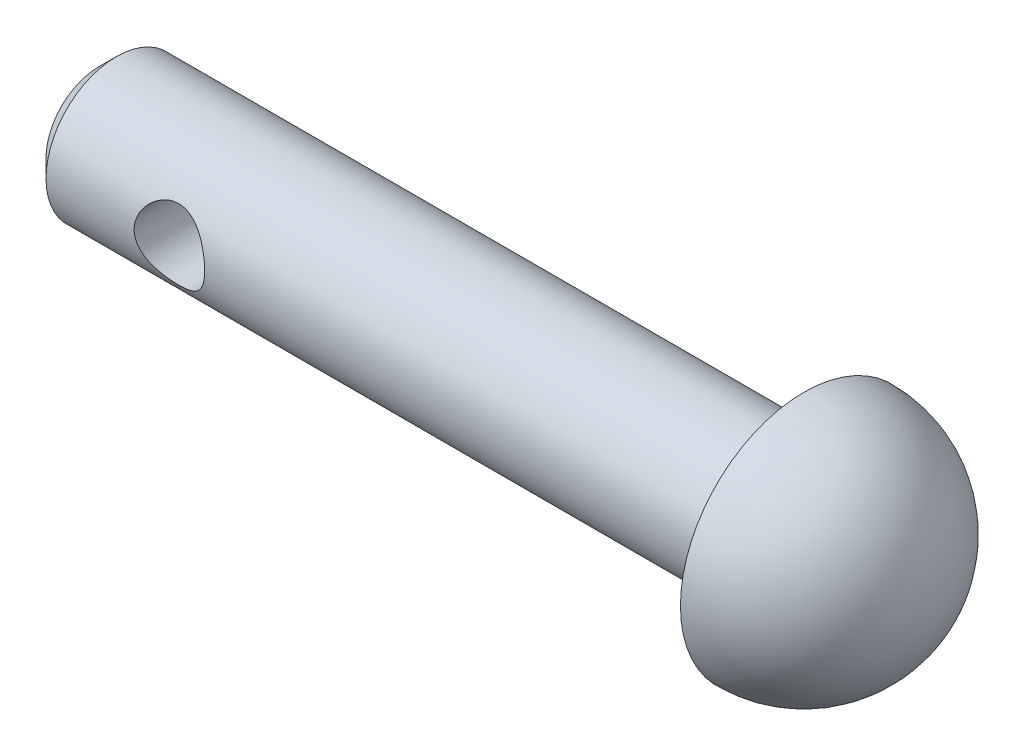
ISO-10303-21;
HEADER;
FILE_DESCRIPTION(('STEP AP214'),'2;1');
FILE_NAME('part.step','',(''),(''),'','','');
FILE_SCHEMA(('AUTOMOTIVE_DESIGN { 1 0 10303 214 1 1 1 1 }'));
ENDSEC;
DATA;
#1=APPLICATION_CONTEXT('core data for automotive mechanical design processes');
#2=APPLICATION_PROTOCOL_DEFINITION('international standard','automotive_design',2000,#1);
#3=PRODUCT_CONTEXT('',#1,'mechanical');
#4=PRODUCT('Part','Part','',(#3));
#5=PRODUCT_RELATED_PRODUCT_CATEGORY('part','',(#4));
#6=PRODUCT_DEFINITION_FORMATION('','',#4);
#7=PRODUCT_DEFINITION_CONTEXT('part definition',#1,'design');
#8=PRODUCT_DEFINITION('design','',#6,#7);
#9=PRODUCT_DEFINITION_SHAPE('','',#8);
#10=(LENGTH_UNIT() NAMED_UNIT(*) SI_UNIT(.MILLI.,.METRE.));
#11=(NAMED_UNIT(*) PLANE_ANGLE_UNIT() SI_UNIT($,.RADIAN.));
#12=(NAMED_UNIT(*) SI_UNIT($,.STERADIAN.) SOLID_ANGLE_UNIT());
#13=UNCERTAINTY_MEASURE_WITH_UNIT(LENGTH_MEASURE(1.E-05),#10,'distance_accuracy_value','');
#14=(GEOMETRIC_REPRESENTATION_CONTEXT(3) GLOBAL_UNCERTAINTY_ASSIGNED_CONTEXT((#13)) GLOBAL_UNIT_ASSIGNED_CONTEXT((#10,
#11,#12)) REPRESENTATION_CONTEXT('',''));
#15=CARTESIAN_POINT('',(0.,0.,0.));
#16=DIRECTION('',(0.,0.,1.));
#17=DIRECTION('',(1.,0.,0.));
#18=AXIS2_PLACEMENT_3D('',#15,#16,#17);
#19=CARTESIAN_POINT('',(0.,0.,0.));
#20=DIRECTION('',(-1.,0.,0.));
#21=DIRECTION('',(0.,1.,0.));
#22=AXIS2_PLACEMENT_3D('',#19,#20,#21);
#23=SPHERICAL_SURFACE('',#22,3.5);
#24=CARTESIAN_POINT('',(0.,0.,0.));
#25=DIRECTION('',(-1.,0.,0.));
#26=DIRECTION('',(0.,0.,1.));
#27=AXIS2_PLACEMENT_3D('',#24,#25,#26);
#28=CIRCLE('',#27,3.5);
#29=CARTESIAN_POINT('',(0.,0.,3.5));
#30=VERTEX_POINT('',#29);
#31=EDGE_CURVE('E45',#30,#30,#28,.T.);
#32=ORIENTED_EDGE('',*,*,#31,.F.);
#33=EDGE_LOOP('',(#32));
#34=FACE_BOUND('',#33,.T.);
#35=ADVANCED_FACE('F33',(#34),#23,.T.);
#36=CARTESIAN_POINT('',(0.,2.,0.));
#37=DIRECTION('',(1.,0.,0.));
#38=DIRECTION('',(0.,0.,-1.));
#39=AXIS2_PLACEMENT_3D('',#36,#37,#38);
#40=PLANE('',#39);
#41=CARTESIAN_POINT('',(0.,0.,0.));
#42=DIRECTION('',(-1.,0.,0.));
#43=DIRECTION('',(0.,0.,1.));
#44=AXIS2_PLACEMENT_3D('',#41,#42,#43);
#45=CIRCLE('',#44,2.);
#46=CARTESIAN_POINT('',(0.,0.,2.));
#47=VERTEX_POINT('',#46);
#48=EDGE_CURVE('E49',#47,#47,#45,.T.);
#49=ORIENTED_EDGE('',*,*,#48,.F.);
#50=EDGE_LOOP('',(#49));
#51=FACE_BOUND('',#50,.T.);
#52=ORIENTED_EDGE('',*,*,#31,.T.);
#53=EDGE_LOOP('',(#52));
#54=FACE_BOUND('',#53,.T.);
#55=ADVANCED_FACE('F78',(#51,#54),#40,.F.);
#56=CARTESIAN_POINT('',(-20.,0.,0.));
#57=DIRECTION('',(-1.,0.,0.));
#58=DIRECTION('',(0.,0.,1.));
#59=AXIS2_PLACEMENT_3D('',#56,#57,#58);
#60=CYLINDRICAL_SURFACE('',#59,2.);
#61=CARTESIAN_POINT('',(-19.5,0.,0.));
#62=DIRECTION('',(1.,0.,0.));
#63=DIRECTION('',(0.,0.,-1.));
#64=AXIS2_PLACEMENT_3D('',#61,#62,#63);
#65=CIRCLE('',#64,2.);
#66=CARTESIAN_POINT('',(-19.5,0.,-2.));
#67=VERTEX_POINT('',#66);
#68=EDGE_CURVE('E10',#67,#67,#65,.T.);
#69=ORIENTED_EDGE('',*,*,#68,.T.);
#70=EDGE_LOOP('',(#69));
#71=FACE_BOUND('',#70,.T.);
#72=CARTESIAN_POINT('',(-15.,0.,2.));
#73=CARTESIAN_POINT('',(-15.0000033023195,-0.0525719629529865,1.99999713404151));
#74=CARTESIAN_POINT('',(-15.0041700731217,-0.105206599698033,1.99790491019518));
#75=CARTESIAN_POINT('',(-15.0206528803409,-0.208920235268425,1.98974156037396));
#76=CARTESIAN_POINT('',(-15.0329843929976,-0.259996086713503,1.98366287828984));
#77=CARTESIAN_POINT('',(-15.0651938086168,-0.358933544880574,1.96816279403312));
#78=CARTESIAN_POINT('',(-15.085042384248,-0.40680680293918,1.9587543917752));
#79=CARTESIAN_POINT('',(-15.1315706213649,-0.498472616806565,1.93745776515779));
#80=CARTESIAN_POINT('',(-15.1582497442489,-0.54226549399005,1.9255697363353));
#81=CARTESIAN_POINT('',(-15.2195172494853,-0.627507817761919,1.89956258258057));
#82=CARTESIAN_POINT('',(-15.2544864792396,-0.668655211122112,1.88535199127536));
#83=CARTESIAN_POINT('',(-15.330521479247,-0.744779444866978,1.85659970246744));
#84=CARTESIAN_POINT('',(-15.3715918517724,-0.779751583106766,1.84205776209035));
#85=CARTESIAN_POINT('',(-15.4624833495234,-0.845252000450278,1.81298951197347));
#86=CARTESIAN_POINT('',(-15.5127360983459,-0.875225335551637,1.79855186970132));
#87=CARTESIAN_POINT('',(-15.6183673359862,-0.926168226890695,1.77285978772321));
#88=CARTESIAN_POINT('',(-15.6737421287227,-0.947144214966334,1.7616030760699));
#89=CARTESIAN_POINT('',(-15.7846651054219,-0.978132442188588,1.74457867037809));
#90=CARTESIAN_POINT('',(-15.8400044520674,-0.988725857080441,1.73852271583714));
#91=CARTESIAN_POINT('',(-15.9519788377795,-1.00042699330885,1.73181889948528));
#92=CARTESIAN_POINT('',(-16.0086125408712,-1.00154408837307,1.73116569343288));
#93=CARTESIAN_POINT('',(-16.1142860243154,-0.994687287172294,1.73510930257248));
#94=CARTESIAN_POINT('',(-16.163424031223,-0.987784559536821,1.73908763662013));
#95=CARTESIAN_POINT('',(-16.259721909373,-0.966939849056933,1.7507622873385));
#96=CARTESIAN_POINT('',(-16.3068811453053,-0.952995623897652,1.75845978831776));
#97=CARTESIAN_POINT('',(-16.3992291325657,-0.918209780386004,1.77687476412741));
#98=CARTESIAN_POINT('',(-16.4443463987858,-0.897215067115995,1.78765840663998));
#99=CARTESIAN_POINT('',(-16.53063429259,-0.849041687668002,1.81103404281404));
#100=CARTESIAN_POINT('',(-16.5718031356001,-0.821860243812467,1.82362684780191));
#101=CARTESIAN_POINT('',(-16.6545212527432,-0.758066054912787,1.85113157903286));
#102=CARTESIAN_POINT('',(-16.6954568735762,-0.720694458369281,1.86613510236746));
#103=CARTESIAN_POINT('',(-16.7707354185909,-0.639555578741373,1.89547623300407));
#104=CARTESIAN_POINT('',(-16.8050751920339,-0.595785256574286,1.90981351958801));
#105=CARTESIAN_POINT('',(-16.8676856610297,-0.50051650583185,1.93701987282964));
#106=CARTESIAN_POINT('',(-16.8956004724457,-0.44875359159941,1.94978984162007));
#107=CARTESIAN_POINT('',(-16.942097029043,-0.340466215488798,1.97157881121242));
#108=CARTESIAN_POINT('',(-16.9606861850152,-0.283945576265277,1.98060078943553));
#109=CARTESIAN_POINT('',(-16.9864754037167,-0.172766491660702,1.99324333741436));
#110=CARTESIAN_POINT('',(-16.9944912357468,-0.118341530548325,1.99724938301312));
#111=CARTESIAN_POINT('',(-17.0014647311345,-0.00877959994935545,2.00073013459102));
#112=CARTESIAN_POINT('',(-17.0004266856395,0.0463570198698992,2.00020698721312));
#113=CARTESIAN_POINT('',(-16.9897933115812,0.151232971985992,1.99491192253441));
#114=CARTESIAN_POINT('',(-16.98086746727,0.201059408049953,1.9904724568819));
#115=CARTESIAN_POINT('',(-16.9557619281049,0.298406892301916,1.97822171314819));
#116=CARTESIAN_POINT('',(-16.9395814335466,0.345927685690995,1.97041006334332));
#117=CARTESIAN_POINT('',(-16.9000015335668,0.438888608449664,1.95184251413669));
#118=CARTESIAN_POINT('',(-16.8764089498832,0.484230397006152,1.94100881769939));
#119=CARTESIAN_POINT('',(-16.822892464354,0.57046136169892,1.91743974317109));
#120=CARTESIAN_POINT('',(-16.7929658654066,0.611348629775281,1.90470355565785));
#121=CARTESIAN_POINT('',(-16.7242395746671,0.691767689290652,1.87708221337464));
#122=CARTESIAN_POINT('',(-16.6848571315464,0.730772077824637,1.86210884848441));
#123=CARTESIAN_POINT('',(-16.6000748487307,0.801856321113238,1.83262391603874));
#124=CARTESIAN_POINT('',(-16.5546708811836,0.83393138569084,1.81811267381526));
#125=CARTESIAN_POINT('',(-16.4563563457997,0.891707914497695,1.79051192226068));
#126=CARTESIAN_POINT('',(-16.4031887337914,0.917025495878636,1.77752529663472));
#127=CARTESIAN_POINT('',(-16.2924899323075,0.958082826013801,1.75574072368126));
#128=CARTESIAN_POINT('',(-16.2349644734988,0.973834915887569,1.74693738240618));
#129=CARTESIAN_POINT('',(-16.1230897771386,0.993861687449678,1.73561501008667));
#130=CARTESIAN_POINT('',(-16.068965746571,0.999092996400864,1.73257383460491));
#131=CARTESIAN_POINT('',(-15.9605529328293,1.00068915438079,1.73165354646175));
#132=CARTESIAN_POINT('',(-15.9062642312606,0.997057846624399,1.73377219627553));
#133=CARTESIAN_POINT('',(-15.804516498468,0.981926125592262,1.74237862050025));
#134=CARTESIAN_POINT('',(-15.7568995298556,0.971208314342799,1.74843094482394));
#135=CARTESIAN_POINT('',(-15.6641918805753,0.943175358224645,1.76371016187918));
#136=CARTESIAN_POINT('',(-15.619102017908,0.92585809115981,1.77293807569676));
#137=CARTESIAN_POINT('',(-15.5293751490134,0.883815745300683,1.79428530364528));
#138=CARTESIAN_POINT('',(-15.4849720981703,0.858671137816458,1.80655722396191));
#139=CARTESIAN_POINT('',(-15.4007254638194,0.802150971636635,1.8323533163459));
#140=CARTESIAN_POINT('',(-15.3608842694815,0.770772171238649,1.84587813794522));
#141=CARTESIAN_POINT('',(-15.2818580176424,0.698203326664642,1.87462323159313));
#142=CARTESIAN_POINT('',(-15.2433408976381,0.656284423010172,1.88984983311469));
#143=CARTESIAN_POINT('',(-15.1737370165764,0.56615480622028,1.91877752255088));
#144=CARTESIAN_POINT('',(-15.1426542605737,0.517940723256785,1.9324777860804));
#145=CARTESIAN_POINT('',(-15.0887636372378,0.415931596819947,1.95698009585103));
#146=CARTESIAN_POINT('',(-15.0660158305886,0.362099503934615,1.96776096562909));
#147=CARTESIAN_POINT('',(-15.030191832081,0.250742101294192,1.98501341363465));
#148=CARTESIAN_POINT('',(-15.0170881531704,0.193227799623167,1.99149723372932));
#149=CARTESIAN_POINT('',(-15.0061025889242,0.112601946483385,1.99695461909663));
#150=CARTESIAN_POINT('',(-15.0038173591364,0.0901618794394995,1.99809365339202));
#151=CARTESIAN_POINT('',(-15.0007653344832,0.0451517318071582,1.99961696977865));
#152=CARTESIAN_POINT('',(-14.9999985815288,0.0225816476473817,2.00000123103763));
#153=CARTESIAN_POINT('',(-15.,0.,2.));
#154=B_SPLINE_CURVE_WITH_KNOTS('',3,(#72,#73,#74,#75,#76,#77,#78,#79,#80,#81,#82,#83,#84,#85,
#86,#87,#88,#89,#90,#91,#92,#93,#94,#95,#96,#97,#98,#99,#100,#101,#102,#103,#104,#105,#106,#107,
#108,#109,#110,#111,#112,#113,#114,#115,#116,#117,#118,#119,#120,#121,#122,#123,#124,#125,#126,
#127,#128,#129,#130,#131,#132,#133,#134,#135,#136,#137,#138,#139,#140,#141,#142,#143,#144,#145,
#146,#147,#148,#149,#150,#151,#152,#153),.UNSPECIFIED.,.T.,.F.,(4,2,2,2,2,2,2,2,2,2,2,2,2,2,2,2,
2,2,2,2,2,2,2,2,2,2,2,2,2,2,2,2,2,2,2,2,2,2,2,2,4),(0.,0.157624257420292,0.315548149709197,
0.472862155492298,0.630163760581567,0.79698175871809,0.963926237654035,1.14381726430753,
1.32357947898281,1.4925801214023,1.6614135732902,1.8100571240932,1.95874803925678,
2.11090240168487,2.26312521260222,2.43464941333878,2.60625534598686,2.7858302221444,
2.96526216912279,3.12983290471345,3.29432564511476,3.44606906506122,3.59782921630931,
3.75392856027898,3.91009450748339,4.08159610644419,4.25321588615431,4.43314682159673,
4.61284511940777,4.77529307498373,4.93767059860005,5.08457930244183,5.23153528783677,
5.38836456775614,5.54527561138957,5.72125242752498,5.89732383376572,6.07464013662925,
6.2514490862493,6.31915280137697,6.38685838514846),.UNSPECIFIED.);
#155=CARTESIAN_POINT('',(-15.,0.,2.));
#156=VERTEX_POINT('',#155);
#157=EDGE_CURVE('E52',#156,#156,#154,.T.);
#158=ORIENTED_EDGE('',*,*,#157,.T.);
#159=EDGE_LOOP('',(#158));
#160=FACE_BOUND('',#159,.T.);
#161=CARTESIAN_POINT('',(-15.,0.,-2.));
#162=CARTESIAN_POINT('',(-15.0000033023195,0.0525719629529865,-1.99999713404151));
#163=CARTESIAN_POINT('',(-15.0041700731217,0.105206599698033,-1.99790491019518));
#164=CARTESIAN_POINT('',(-15.0206528803409,0.208920235268425,-1.98974156037396));
#165=CARTESIAN_POINT('',(-15.0329843929976,0.259996086713503,-1.98366287828984));
#166=CARTESIAN_POINT('',(-15.0651938086168,0.358933544880574,-1.96816279403312));
#167=CARTESIAN_POINT('',(-15.085042384248,0.40680680293918,-1.9587543917752));
#168=CARTESIAN_POINT('',(-15.1315706213649,0.498472616806565,-1.93745776515779));
#169=CARTESIAN_POINT('',(-15.1582497442489,0.54226549399005,-1.9255697363353));
#170=CARTESIAN_POINT('',(-15.2195172494853,0.627507817761919,-1.89956258258057));
#171=CARTESIAN_POINT('',(-15.2544864792396,0.668655211122112,-1.88535199127536));
#172=CARTESIAN_POINT('',(-15.330521479247,0.744779444866978,-1.85659970246744));
#173=CARTESIAN_POINT('',(-15.3715918517724,0.779751583106766,-1.84205776209035));
#174=CARTESIAN_POINT('',(-15.4624833495234,0.845252000450278,-1.81298951197347));
#175=CARTESIAN_POINT('',(-15.5127360983459,0.875225335551637,-1.79855186970132));
#176=CARTESIAN_POINT('',(-15.6183673359862,0.926168226890695,-1.77285978772321));
#177=CARTESIAN_POINT('',(-15.6737421287227,0.947144214966334,-1.7616030760699));
#178=CARTESIAN_POINT('',(-15.7846651054219,0.978132442188588,-1.74457867037809));
#179=CARTESIAN_POINT('',(-15.8400044520674,0.988725857080441,-1.73852271583714));
#180=CARTESIAN_POINT('',(-15.9519788377795,1.00042699330885,-1.73181889948528));
#181=CARTESIAN_POINT('',(-16.0086125408712,1.00154408837307,-1.73116569343288));
#182=CARTESIAN_POINT('',(-16.1142860243154,0.994687287172294,-1.73510930257248));
#183=CARTESIAN_POINT('',(-16.163424031223,0.987784559536821,-1.73908763662013));
#184=CARTESIAN_POINT('',(-16.259721909373,0.966939849056933,-1.7507622873385));
#185=CARTESIAN_POINT('',(-16.3068811453053,0.952995623897652,-1.75845978831776));
#186=CARTESIAN_POINT('',(-16.3992291325657,0.918209780386004,-1.77687476412741));
#187=CARTESIAN_POINT('',(-16.4443463987858,0.897215067115995,-1.78765840663998));
#188=CARTESIAN_POINT('',(-16.53063429259,0.849041687668002,-1.81103404281404));
#189=CARTESIAN_POINT('',(-16.5718031356001,0.821860243812467,-1.82362684780191));
#190=CARTESIAN_POINT('',(-16.6545212527432,0.758066054912787,-1.85113157903286));
#191=CARTESIAN_POINT('',(-16.6954568735762,0.720694458369281,-1.86613510236746));
#192=CARTESIAN_POINT('',(-16.7707354185909,0.639555578741373,-1.89547623300407));
#193=CARTESIAN_POINT('',(-16.8050751920339,0.595785256574286,-1.90981351958801));
#194=CARTESIAN_POINT('',(-16.8676856610297,0.50051650583185,-1.93701987282964));
#195=CARTESIAN_POINT('',(-16.8956004724457,0.44875359159941,-1.94978984162007));
#196=CARTESIAN_POINT('',(-16.942097029043,0.340466215488798,-1.97157881121242));
#197=CARTESIAN_POINT('',(-16.9606861850152,0.283945576265277,-1.98060078943553));
#198=CARTESIAN_POINT('',(-16.9864754037167,0.172766491660702,-1.99324333741436));
#199=CARTESIAN_POINT('',(-16.9944912357468,0.118341530548325,-1.99724938301312));
#200=CARTESIAN_POINT('',(-17.0014647311345,0.00877959994935545,-2.00073013459102));
#201=CARTESIAN_POINT('',(-17.0004266856395,-0.0463570198698992,-2.00020698721312));
#202=CARTESIAN_POINT('',(-16.9897933115812,-0.151232971985992,-1.99491192253441));
#203=CARTESIAN_POINT('',(-16.98086746727,-0.201059408049953,-1.9904724568819));
#204=CARTESIAN_POINT('',(-16.9557619281049,-0.298406892301916,-1.97822171314819));
#205=CARTESIAN_POINT('',(-16.9395814335466,-0.345927685690995,-1.97041006334332));
#206=CARTESIAN_POINT('',(-16.9000015335668,-0.438888608449664,-1.95184251413669));
#207=CARTESIAN_POINT('',(-16.8764089498832,-0.484230397006152,-1.94100881769939));
#208=CARTESIAN_POINT('',(-16.822892464354,-0.57046136169892,-1.91743974317109));
#209=CARTESIAN_POINT('',(-16.7929658654066,-0.611348629775281,-1.90470355565785));
#210=CARTESIAN_POINT('',(-16.7242395746671,-0.691767689290652,-1.87708221337464));
#211=CARTESIAN_POINT('',(-16.6848571315464,-0.730772077824637,-1.86210884848441));
#212=CARTESIAN_POINT('',(-16.6000748487307,-0.801856321113238,-1.83262391603874));
#213=CARTESIAN_POINT('',(-16.5546708811836,-0.83393138569084,-1.81811267381526));
#214=CARTESIAN_POINT('',(-16.4563563457997,-0.891707914497695,-1.79051192226068));
#215=CARTESIAN_POINT('',(-16.4031887337914,-0.917025495878636,-1.77752529663472));
#216=CARTESIAN_POINT('',(-16.2924899323075,-0.958082826013801,-1.75574072368126));
#217=CARTESIAN_POINT('',(-16.2349644734988,-0.973834915887569,-1.74693738240618));
#218=CARTESIAN_POINT('',(-16.1230897771386,-0.993861687449678,-1.73561501008667));
#219=CARTESIAN_POINT('',(-16.068965746571,-0.999092996400864,-1.73257383460491));
#220=CARTESIAN_POINT('',(-15.9605529328293,-1.00068915438079,-1.73165354646175));
#221=CARTESIAN_POINT('',(-15.9062642312606,-0.997057846624399,-1.73377219627553));
#222=CARTESIAN_POINT('',(-15.804516498468,-0.981926125592262,-1.74237862050025));
#223=CARTESIAN_POINT('',(-15.7568995298556,-0.971208314342799,-1.74843094482394));
#224=CARTESIAN_POINT('',(-15.6641918805753,-0.943175358224645,-1.76371016187918));
#225=CARTESIAN_POINT('',(-15.619102017908,-0.92585809115981,-1.77293807569676));
#226=CARTESIAN_POINT('',(-15.5293751490134,-0.883815745300683,-1.79428530364528));
#227=CARTESIAN_POINT('',(-15.4849720981703,-0.858671137816458,-1.80655722396191));
#228=CARTESIAN_POINT('',(-15.4007254638194,-0.802150971636635,-1.8323533163459));
#229=CARTESIAN_POINT('',(-15.3608842694815,-0.770772171238649,-1.84587813794522));
#230=CARTESIAN_POINT('',(-15.2818580176424,-0.698203326664642,-1.87462323159313));
#231=CARTESIAN_POINT('',(-15.2433408976381,-0.656284423010172,-1.88984983311469));
#232=CARTESIAN_POINT('',(-15.1737370165764,-0.56615480622028,-1.91877752255088));
#233=CARTESIAN_POINT('',(-15.1426542605737,-0.517940723256785,-1.9324777860804));
#234=CARTESIAN_POINT('',(-15.0887636372378,-0.415931596819947,-1.95698009585103));
#235=CARTESIAN_POINT('',(-15.0660158305886,-0.362099503934615,-1.96776096562909));
#236=CARTESIAN_POINT('',(-15.030191832081,-0.250742101294192,-1.98501341363465));
#237=CARTESIAN_POINT('',(-15.0170881531704,-0.193227799623167,-1.99149723372932));
#238=CARTESIAN_POINT('',(-15.0061025889242,-0.112601946483385,-1.99695461909663));
#239=CARTESIAN_POINT('',(-15.0038173591364,-0.0901618794394995,-1.99809365339202));
#240=CARTESIAN_POINT('',(-15.0007653344832,-0.0451517318071582,-1.99961696977865));
#241=CARTESIAN_POINT('',(-14.9999985815288,-0.0225816476473817,-2.00000123103763));
#242=CARTESIAN_POINT('',(-15.,0.,-2.));
#243=B_SPLINE_CURVE_WITH_KNOTS('',3,(#161,#162,#163,#164,#165,#166,#167,#168,#169,#170,#171,
#172,#173,#174,#175,#176,#177,#178,#179,#180,#181,#182,#183,#184,#185,#186,#187,#188,#189,#190,
#191,#192,#193,#194,#195,#196,#197,#198,#199,#200,#201,#202,#203,#204,#205,#206,#207,#208,#209,
#210,#211,#212,#213,#214,#215,#216,#217,#218,#219,#220,#221,#222,#223,#224,#225,#226,#227,#228,
#229,#230,#231,#232,#233,#234,#235,#236,#237,#238,#239,#240,#241,#242),.UNSPECIFIED.,.T.,.F.,(4,
2,2,2,2,2,2,2,2,2,2,2,2,2,2,2,2,2,2,2,2,2,2,2,2,2,2,2,2,2,2,2,2,2,2,2,2,2,2,2,4),(0.,
0.157624257420292,0.315548149709197,0.472862155492298,0.630163760581567,0.79698175871809,
0.963926237654035,1.14381726430753,1.32357947898281,1.4925801214023,1.6614135732902,
1.8100571240932,1.95874803925678,2.11090240168487,2.26312521260222,2.43464941333878,
2.60625534598686,2.7858302221444,2.96526216912279,3.12983290471345,3.29432564511476,
3.44606906506122,3.59782921630931,3.75392856027898,3.91009450748339,4.08159610644419,
4.25321588615431,4.43314682159673,4.61284511940777,4.77529307498373,4.93767059860005,
5.08457930244183,5.23153528783677,5.38836456775614,5.54527561138957,5.72125242752498,
5.89732383376572,6.07464013662925,6.2514490862493,6.31915280137697,6.38685838514846),.UNSPECIFIED.);
#244=CARTESIAN_POINT('',(-15.,0.,-2.));
#245=VERTEX_POINT('',#244);
#246=EDGE_CURVE('E60',#245,#245,#243,.T.);
#247=ORIENTED_EDGE('',*,*,#246,.T.);
#248=EDGE_LOOP('',(#247));
#249=FACE_BOUND('',#248,.T.);
#250=ORIENTED_EDGE('',*,*,#48,.T.);
#251=EDGE_LOOP('',(#250));
#252=FACE_BOUND('',#251,.T.);
#253=ADVANCED_FACE('F64',(#71,#160,#249,#252),#60,.T.);
#254=CARTESIAN_POINT('',(-20.,0.,0.));
#255=DIRECTION('',(1.,0.,0.));
#256=DIRECTION('',(0.,0.,-1.));
#257=AXIS2_PLACEMENT_3D('',#254,#255,#256);
#258=PLANE('',#257);
#259=CARTESIAN_POINT('',(-20.,0.,0.));
#260=DIRECTION('',(1.,0.,0.));
#261=DIRECTION('',(0.,0.,-1.));
#262=AXIS2_PLACEMENT_3D('',#259,#260,#261);
#263=CIRCLE('',#262,1.49999999999999);
#264=CARTESIAN_POINT('',(-20.,0.,-1.49999999999999));
#265=VERTEX_POINT('',#264);
#266=EDGE_CURVE('E41',#265,#265,#263,.F.);
#267=ORIENTED_EDGE('',*,*,#266,.T.);
#268=EDGE_LOOP('',(#267));
#269=FACE_BOUND('',#268,.T.);
#270=ADVANCED_FACE('F71',(#269),#258,.F.);
#271=CARTESIAN_POINT('',(-16.,0.,-3.5));
#272=DIRECTION('',(0.,0.,1.));
#273=DIRECTION('',(1.,0.,0.));
#274=AXIS2_PLACEMENT_3D('',#271,#272,#273);
#275=CYLINDRICAL_SURFACE('',#274,1.);
#276=ORIENTED_EDGE('',*,*,#246,.F.);
#277=EDGE_LOOP('',(#276));
#278=FACE_BOUND('',#277,.T.);
#279=ORIENTED_EDGE('',*,*,#157,.F.);
#280=EDGE_LOOP('',(#279));
#281=FACE_BOUND('',#280,.T.);
#282=ADVANCED_FACE('F68',(#278,#281),#275,.F.);
#283=CARTESIAN_POINT('',(-20.,0.,0.));
#284=DIRECTION('',(1.,0.,0.));
#285=DIRECTION('',(0.,0.,-1.));
#286=AXIS2_PLACEMENT_3D('',#283,#284,#285);
#287=CONICAL_SURFACE('',#286,1.49999999999999,0.78539816339745);
#288=ORIENTED_EDGE('',*,*,#68,.F.);
#289=EDGE_LOOP('',(#288));
#290=FACE_BOUND('',#289,.T.);
#291=ORIENTED_EDGE('',*,*,#266,.F.);
#292=EDGE_LOOP('',(#291));
#293=FACE_BOUND('',#292,.T.);
#294=ADVANCED_FACE('F36',(#290,#293),#287,.T.);
#295=CLOSED_SHELL('',(#35,#55,#253,#270,#282,#294));
#296=MANIFOLD_SOLID_BREP('B2',#295);
#297=ADVANCED_BREP_SHAPE_REPRESENTATION('',(#18,#296),#14);
#298=SHAPE_DEFINITION_REPRESENTATION(#9,#297);
ENDSEC;
END-ISO-10303-21;
